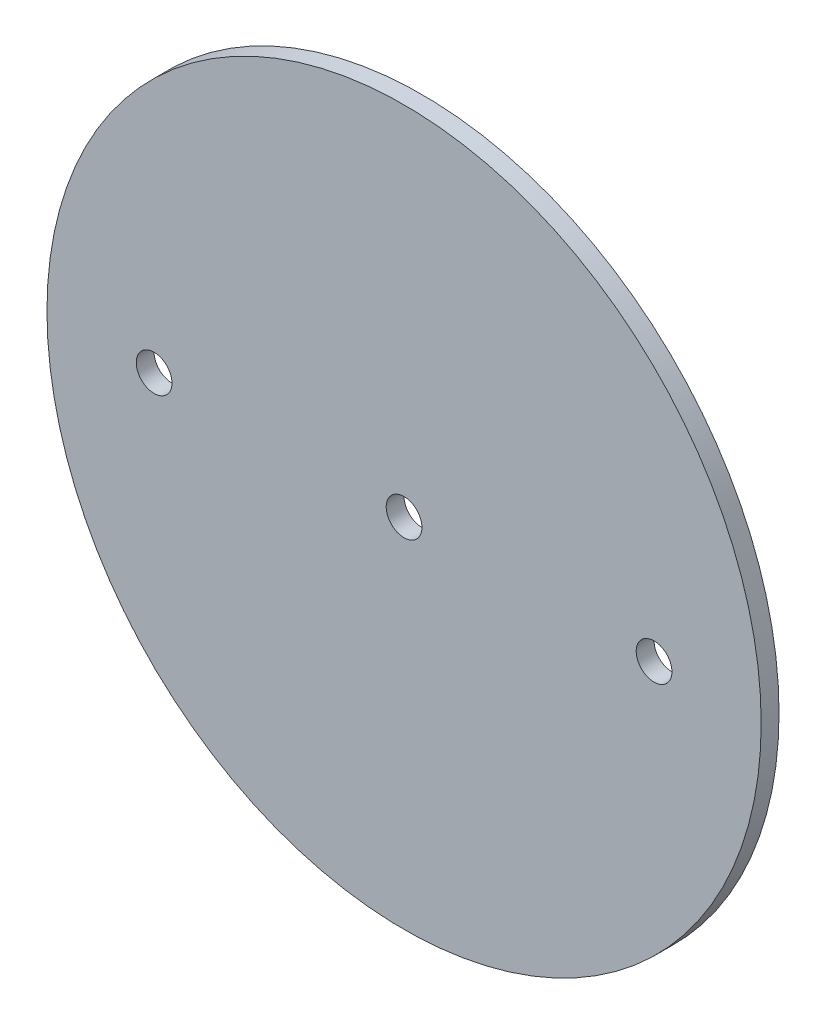
ISO-10303-21;
HEADER;
FILE_DESCRIPTION(('STEP AP214'),'2;1');
FILE_NAME('part.step','',(''),(''),'','','');
FILE_SCHEMA(('AUTOMOTIVE_DESIGN { 1 0 10303 214 1 1 1 1 }'));
ENDSEC;
DATA;
#1=APPLICATION_CONTEXT('core data for automotive mechanical design processes');
#2=APPLICATION_PROTOCOL_DEFINITION('international standard','automotive_design',2000,#1);
#3=PRODUCT_CONTEXT('',#1,'mechanical');
#4=PRODUCT('Part','Part','',(#3));
#5=PRODUCT_RELATED_PRODUCT_CATEGORY('part','',(#4));
#6=PRODUCT_DEFINITION_FORMATION('','',#4);
#7=PRODUCT_DEFINITION_CONTEXT('part definition',#1,'design');
#8=PRODUCT_DEFINITION('design','',#6,#7);
#9=PRODUCT_DEFINITION_SHAPE('','',#8);
#10=(LENGTH_UNIT() NAMED_UNIT(*) SI_UNIT(.MILLI.,.METRE.));
#11=(NAMED_UNIT(*) PLANE_ANGLE_UNIT() SI_UNIT($,.RADIAN.));
#12=(NAMED_UNIT(*) SI_UNIT($,.STERADIAN.) SOLID_ANGLE_UNIT());
#13=UNCERTAINTY_MEASURE_WITH_UNIT(LENGTH_MEASURE(1.E-05),#10,'distance_accuracy_value','');
#14=(GEOMETRIC_REPRESENTATION_CONTEXT(3) GLOBAL_UNCERTAINTY_ASSIGNED_CONTEXT((#13)) GLOBAL_UNIT_ASSIGNED_CONTEXT((#10,
#11,#12)) REPRESENTATION_CONTEXT('',''));
#15=CARTESIAN_POINT('',(0.,0.,0.));
#16=DIRECTION('',(0.,0.,1.));
#17=DIRECTION('',(1.,0.,0.));
#18=AXIS2_PLACEMENT_3D('',#15,#16,#17);
#19=CARTESIAN_POINT('',(0.,0.,1.5875));
#20=DIRECTION('',(0.,0.,-1.));
#21=DIRECTION('',(-1.,0.,0.));
#22=AXIS2_PLACEMENT_3D('',#19,#20,#21);
#23=CYLINDRICAL_SURFACE('',#22,63.5);
#24=CARTESIAN_POINT('',(0.,0.,1.5875));
#25=DIRECTION('',(0.,0.,1.));
#26=DIRECTION('',(1.,0.,0.));
#27=AXIS2_PLACEMENT_3D('',#24,#25,#26);
#28=CIRCLE('',#27,63.5);
#29=CARTESIAN_POINT('',(63.5,0.,1.5875));
#30=VERTEX_POINT('',#29);
#31=EDGE_CURVE('E10',#30,#30,#28,.T.);
#32=ORIENTED_EDGE('',*,*,#31,.F.);
#33=EDGE_LOOP('',(#32));
#34=FACE_BOUND('',#33,.T.);
#35=CARTESIAN_POINT('',(0.,0.,-1.5875));
#36=DIRECTION('',(0.,0.,1.));
#37=DIRECTION('',(1.,0.,0.));
#38=AXIS2_PLACEMENT_3D('',#35,#36,#37);
#39=CIRCLE('',#38,63.5);
#40=CARTESIAN_POINT('',(63.5,0.,-1.5875));
#41=VERTEX_POINT('',#40);
#42=EDGE_CURVE('E40',#41,#41,#39,.T.);
#43=ORIENTED_EDGE('',*,*,#42,.T.);
#44=EDGE_LOOP('',(#43));
#45=FACE_BOUND('',#44,.T.);
#46=ADVANCED_FACE('F37',(#34,#45),#23,.T.);
#47=CARTESIAN_POINT('',(0.,0.,1.5875));
#48=DIRECTION('',(0.,0.,1.));
#49=DIRECTION('',(1.,0.,0.));
#50=AXIS2_PLACEMENT_3D('',#47,#48,#49);
#51=PLANE('',#50);
#52=CARTESIAN_POINT('',(0.,0.,1.5875));
#53=DIRECTION('',(0.,0.,1.));
#54=DIRECTION('',(1.,0.,0.));
#55=AXIS2_PLACEMENT_3D('',#52,#53,#54);
#56=CIRCLE('',#55,3.17499999999999);
#57=CARTESIAN_POINT('',(3.17499999999999,0.,1.5875));
#58=VERTEX_POINT('',#57);
#59=EDGE_CURVE('E63',#58,#58,#56,.T.);
#60=ORIENTED_EDGE('',*,*,#59,.F.);
#61=EDGE_LOOP('',(#60));
#62=FACE_BOUND('',#61,.T.);
#63=CARTESIAN_POINT('',(44.45,0.,1.5875));
#64=DIRECTION('',(0.,0.,1.));
#65=DIRECTION('',(1.,0.,0.));
#66=AXIS2_PLACEMENT_3D('',#63,#64,#65);
#67=CIRCLE('',#66,3.17499999999998);
#68=CARTESIAN_POINT('',(47.625,0.,1.5875));
#69=VERTEX_POINT('',#68);
#70=EDGE_CURVE('E57',#69,#69,#67,.T.);
#71=ORIENTED_EDGE('',*,*,#70,.F.);
#72=EDGE_LOOP('',(#71));
#73=FACE_BOUND('',#72,.T.);
#74=CARTESIAN_POINT('',(-44.45,0.,1.5875));
#75=DIRECTION('',(0.,0.,1.));
#76=DIRECTION('',(1.,0.,0.));
#77=AXIS2_PLACEMENT_3D('',#74,#75,#76);
#78=CIRCLE('',#77,3.17499999999999);
#79=CARTESIAN_POINT('',(-41.275,0.,1.5875));
#80=VERTEX_POINT('',#79);
#81=EDGE_CURVE('E51',#80,#80,#78,.T.);
#82=ORIENTED_EDGE('',*,*,#81,.F.);
#83=EDGE_LOOP('',(#82));
#84=FACE_BOUND('',#83,.T.);
#85=ORIENTED_EDGE('',*,*,#31,.T.);
#86=EDGE_LOOP('',(#85));
#87=FACE_BOUND('',#86,.T.);
#88=ADVANCED_FACE('F69',(#62,#73,#84,#87),#51,.T.);
#89=CARTESIAN_POINT('',(0.,0.,-1.5875));
#90=DIRECTION('',(0.,0.,1.));
#91=DIRECTION('',(1.,0.,0.));
#92=AXIS2_PLACEMENT_3D('',#89,#90,#91);
#93=PLANE('',#92);
#94=CARTESIAN_POINT('',(0.,0.,-1.5875));
#95=DIRECTION('',(0.,0.,1.));
#96=DIRECTION('',(1.,0.,0.));
#97=AXIS2_PLACEMENT_3D('',#94,#95,#96);
#98=CIRCLE('',#97,3.17499999999999);
#99=CARTESIAN_POINT('',(3.17499999999999,0.,-1.5875));
#100=VERTEX_POINT('',#99);
#101=EDGE_CURVE('E60',#100,#100,#98,.T.);
#102=ORIENTED_EDGE('',*,*,#101,.T.);
#103=EDGE_LOOP('',(#102));
#104=FACE_BOUND('',#103,.T.);
#105=CARTESIAN_POINT('',(44.45,0.,-1.5875));
#106=DIRECTION('',(0.,0.,1.));
#107=DIRECTION('',(1.,0.,0.));
#108=AXIS2_PLACEMENT_3D('',#105,#106,#107);
#109=CIRCLE('',#108,3.17499999999999);
#110=CARTESIAN_POINT('',(47.625,0.,-1.5875));
#111=VERTEX_POINT('',#110);
#112=EDGE_CURVE('E54',#111,#111,#109,.T.);
#113=ORIENTED_EDGE('',*,*,#112,.T.);
#114=EDGE_LOOP('',(#113));
#115=FACE_BOUND('',#114,.T.);
#116=CARTESIAN_POINT('',(-44.45,0.,-1.5875));
#117=DIRECTION('',(0.,0.,1.));
#118=DIRECTION('',(1.,0.,0.));
#119=AXIS2_PLACEMENT_3D('',#116,#117,#118);
#120=CIRCLE('',#119,3.17499999999999);
#121=CARTESIAN_POINT('',(-41.275,0.,-1.5875));
#122=VERTEX_POINT('',#121);
#123=EDGE_CURVE('E47',#122,#122,#120,.T.);
#124=ORIENTED_EDGE('',*,*,#123,.T.);
#125=EDGE_LOOP('',(#124));
#126=FACE_BOUND('',#125,.T.);
#127=ORIENTED_EDGE('',*,*,#42,.F.);
#128=EDGE_LOOP('',(#127));
#129=FACE_BOUND('',#128,.T.);
#130=ADVANCED_FACE('F72',(#104,#115,#126,#129),#93,.F.);
#131=CARTESIAN_POINT('',(-44.45,0.,1.5875));
#132=DIRECTION('',(0.,0.,1.));
#133=DIRECTION('',(1.,0.,0.));
#134=AXIS2_PLACEMENT_3D('',#131,#132,#133);
#135=CYLINDRICAL_SURFACE('',#134,3.17499999999999);
#136=ORIENTED_EDGE('',*,*,#123,.F.);
#137=EDGE_LOOP('',(#136));
#138=FACE_BOUND('',#137,.T.);
#139=ORIENTED_EDGE('',*,*,#81,.T.);
#140=EDGE_LOOP('',(#139));
#141=FACE_BOUND('',#140,.T.);
#142=ADVANCED_FACE('F78',(#138,#141),#135,.F.);
#143=CARTESIAN_POINT('',(44.45,0.,1.5875));
#144=DIRECTION('',(0.,0.,1.));
#145=DIRECTION('',(1.,0.,0.));
#146=AXIS2_PLACEMENT_3D('',#143,#144,#145);
#147=CYLINDRICAL_SURFACE('',#146,3.17499999999999);
#148=ORIENTED_EDGE('',*,*,#112,.F.);
#149=EDGE_LOOP('',(#148));
#150=FACE_BOUND('',#149,.T.);
#151=ORIENTED_EDGE('',*,*,#70,.T.);
#152=EDGE_LOOP('',(#151));
#153=FACE_BOUND('',#152,.T.);
#154=ADVANCED_FACE('F80',(#150,#153),#147,.F.);
#155=CARTESIAN_POINT('',(0.,0.,1.5875));
#156=DIRECTION('',(0.,0.,1.));
#157=DIRECTION('',(1.,0.,0.));
#158=AXIS2_PLACEMENT_3D('',#155,#156,#157);
#159=CYLINDRICAL_SURFACE('',#158,3.17499999999999);
#160=ORIENTED_EDGE('',*,*,#101,.F.);
#161=EDGE_LOOP('',(#160));
#162=FACE_BOUND('',#161,.T.);
#163=ORIENTED_EDGE('',*,*,#59,.T.);
#164=EDGE_LOOP('',(#163));
#165=FACE_BOUND('',#164,.T.);
#166=ADVANCED_FACE('F67',(#162,#165),#159,.F.);
#167=CLOSED_SHELL('',(#46,#88,#130,#142,#154,#166));
#168=MANIFOLD_SOLID_BREP('B2',#167);
#169=ADVANCED_BREP_SHAPE_REPRESENTATION('',(#18,#168),#14);
#170=SHAPE_DEFINITION_REPRESENTATION(#9,#169);
ENDSEC;
END-ISO-10303-21;
